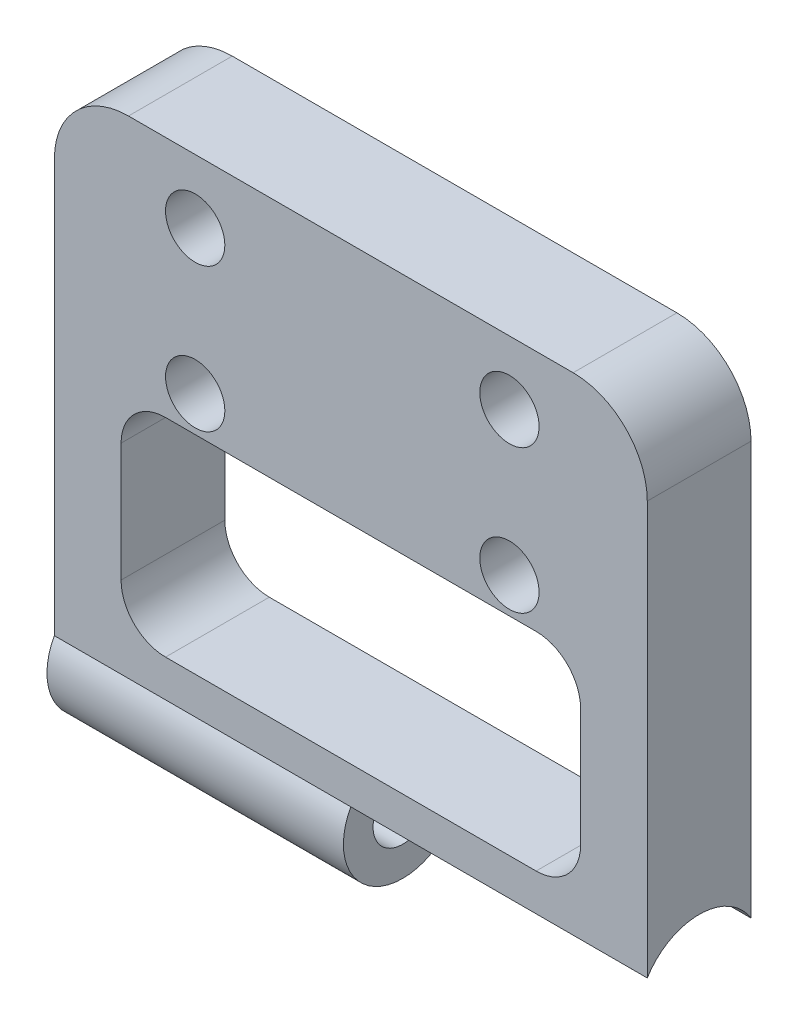
ISO-10303-21;
HEADER;
FILE_DESCRIPTION(('STEP AP214'),'2;1');
FILE_NAME('part.step','',(''),(''),'','','');
FILE_SCHEMA(('AUTOMOTIVE_DESIGN { 1 0 10303 214 1 1 1 1 }'));
ENDSEC;
DATA;
#1=APPLICATION_CONTEXT('core data for automotive mechanical design processes');
#2=APPLICATION_PROTOCOL_DEFINITION('international standard','automotive_design',2000,#1);
#3=PRODUCT_CONTEXT('',#1,'mechanical');
#4=PRODUCT('Part','Part','',(#3));
#5=PRODUCT_RELATED_PRODUCT_CATEGORY('part','',(#4));
#6=PRODUCT_DEFINITION_FORMATION('','',#4);
#7=PRODUCT_DEFINITION_CONTEXT('part definition',#1,'design');
#8=PRODUCT_DEFINITION('design','',#6,#7);
#9=PRODUCT_DEFINITION_SHAPE('','',#8);
#10=(LENGTH_UNIT() NAMED_UNIT(*) SI_UNIT(.MILLI.,.METRE.));
#11=(NAMED_UNIT(*) PLANE_ANGLE_UNIT() SI_UNIT($,.RADIAN.));
#12=(NAMED_UNIT(*) SI_UNIT($,.STERADIAN.) SOLID_ANGLE_UNIT());
#13=UNCERTAINTY_MEASURE_WITH_UNIT(LENGTH_MEASURE(1.E-05),#10,'distance_accuracy_value','');
#14=(GEOMETRIC_REPRESENTATION_CONTEXT(3) GLOBAL_UNCERTAINTY_ASSIGNED_CONTEXT((#13)) GLOBAL_UNIT_ASSIGNED_CONTEXT((#10,
#11,#12)) REPRESENTATION_CONTEXT('',''));
#15=CARTESIAN_POINT('',(0.,0.,0.));
#16=DIRECTION('',(0.,0.,1.));
#17=DIRECTION('',(1.,0.,0.));
#18=AXIS2_PLACEMENT_3D('',#15,#16,#17);
#19=CARTESIAN_POINT('',(0.,0.,7.));
#20=DIRECTION('',(0.,0.,1.));
#21=DIRECTION('',(1.,0.,0.));
#22=AXIS2_PLACEMENT_3D('',#19,#20,#21);
#23=PLANE('',#22);
#24=DIRECTION('',(0.,-1.,0.));
#25=VECTOR('',#24,1.);
#26=CARTESIAN_POINT('',(-17.7292131790813,0.,7.));
#27=LINE('',#26,#25);
#28=CARTESIAN_POINT('',(-17.7292131790813,-2.9002044023642,7.));
#29=VERTEX_POINT('',#28);
#30=CARTESIAN_POINT('',(-17.7292131790813,-10.9002044023642,7.));
#31=VERTEX_POINT('',#30);
#32=EDGE_CURVE('E234',#29,#31,#27,.T.);
#33=ORIENTED_EDGE('',*,*,#32,.F.);
#34=CARTESIAN_POINT('',(-14.7292131790813,-2.9002044023642,7.));
#35=DIRECTION('',(0.,0.,1.));
#36=DIRECTION('',(1.,0.,0.));
#37=AXIS2_PLACEMENT_3D('',#34,#35,#36);
#38=CIRCLE('',#37,3.);
#39=CARTESIAN_POINT('',(-14.7292131790813,0.0997955976357979,7.));
#40=VERTEX_POINT('',#39);
#41=EDGE_CURVE('E11',#29,#40,#38,.F.);
#42=ORIENTED_EDGE('',*,*,#41,.T.);
#43=DIRECTION('',(-1.,0.,0.));
#44=VECTOR('',#43,1.);
#45=CARTESIAN_POINT('',(0.,0.0997955976357961,7.));
#46=LINE('',#45,#44);
#47=CARTESIAN_POINT('',(10.2707868209187,0.0997955976357948,7.));
#48=VERTEX_POINT('',#47);
#49=EDGE_CURVE('E302',#48,#40,#46,.T.);
#50=ORIENTED_EDGE('',*,*,#49,.F.);
#51=CARTESIAN_POINT('',(10.2707868209187,-2.90020440236421,7.));
#52=DIRECTION('',(0.,0.,1.));
#53=DIRECTION('',(1.,0.,0.));
#54=AXIS2_PLACEMENT_3D('',#51,#52,#53);
#55=CIRCLE('',#54,3.);
#56=CARTESIAN_POINT('',(13.2707868209187,-2.90020440236421,7.));
#57=VERTEX_POINT('',#56);
#58=EDGE_CURVE('E220',#48,#57,#55,.F.);
#59=ORIENTED_EDGE('',*,*,#58,.T.);
#60=DIRECTION('',(0.,1.,0.));
#61=VECTOR('',#60,1.);
#62=CARTESIAN_POINT('',(13.2707868209187,0.,7.));
#63=LINE('',#62,#61);
#64=CARTESIAN_POINT('',(13.2707868209187,-10.9002044023642,7.));
#65=VERTEX_POINT('',#64);
#66=EDGE_CURVE('E299',#65,#57,#63,.T.);
#67=ORIENTED_EDGE('',*,*,#66,.F.);
#68=CARTESIAN_POINT('',(10.2707868209187,-10.9002044023642,7.));
#69=DIRECTION('',(0.,0.,1.));
#70=DIRECTION('',(1.,0.,0.));
#71=AXIS2_PLACEMENT_3D('',#68,#69,#70);
#72=CIRCLE('',#71,3.);
#73=CARTESIAN_POINT('',(10.2707868209187,-13.9002044023642,7.));
#74=VERTEX_POINT('',#73);
#75=EDGE_CURVE('E224',#65,#74,#72,.F.);
#76=ORIENTED_EDGE('',*,*,#75,.T.);
#77=DIRECTION('',(1.,0.,0.));
#78=VECTOR('',#77,1.);
#79=CARTESIAN_POINT('',(0.,-13.9002044023642,7.));
#80=LINE('',#79,#78);
#81=CARTESIAN_POINT('',(-14.7292131790813,-13.9002044023642,7.));
#82=VERTEX_POINT('',#81);
#83=EDGE_CURVE('E237',#82,#74,#80,.T.);
#84=ORIENTED_EDGE('',*,*,#83,.F.);
#85=CARTESIAN_POINT('',(-14.7292131790813,-10.9002044023642,7.));
#86=DIRECTION('',(0.,0.,1.));
#87=DIRECTION('',(1.,0.,0.));
#88=AXIS2_PLACEMENT_3D('',#85,#86,#87);
#89=CIRCLE('',#88,3.);
#90=EDGE_CURVE('E227',#82,#31,#89,.F.);
#91=ORIENTED_EDGE('',*,*,#90,.T.);
#92=EDGE_LOOP('',(#33,#42,#50,#59,#67,#76,#84,#91));
#93=FACE_BOUND('',#92,.T.);
#94=CARTESIAN_POINT('',(8.47078682091913,2.4893799472293,7.));
#95=DIRECTION('',(0.,0.,1.));
#96=DIRECTION('',(1.,0.,0.));
#97=AXIS2_PLACEMENT_3D('',#94,#95,#96);
#98=CIRCLE('',#97,2.0000000000005);
#99=CARTESIAN_POINT('',(10.4707868209196,2.4893799472293,7.));
#100=VERTEX_POINT('',#99);
#101=EDGE_CURVE('E315',#100,#100,#98,.T.);
#102=ORIENTED_EDGE('',*,*,#101,.F.);
#103=EDGE_LOOP('',(#102));
#104=FACE_BOUND('',#103,.T.);
#105=CARTESIAN_POINT('',(-12.7292131790809,2.48937994722929,7.));
#106=DIRECTION('',(0.,0.,1.));
#107=DIRECTION('',(1.,0.,0.));
#108=AXIS2_PLACEMENT_3D('',#105,#106,#107);
#109=CIRCLE('',#108,2.0000000000005);
#110=CARTESIAN_POINT('',(-10.7292131790804,2.48937994722929,7.));
#111=VERTEX_POINT('',#110);
#112=EDGE_CURVE('E321',#111,#111,#109,.T.);
#113=ORIENTED_EDGE('',*,*,#112,.F.);
#114=EDGE_LOOP('',(#113));
#115=FACE_BOUND('',#114,.T.);
#116=CARTESIAN_POINT('',(-12.7292131790809,12.1643799472293,7.));
#117=DIRECTION('',(0.,0.,1.));
#118=DIRECTION('',(1.,0.,0.));
#119=AXIS2_PLACEMENT_3D('',#116,#117,#118);
#120=CIRCLE('',#119,2.0000000000005);
#121=CARTESIAN_POINT('',(-10.7292131790804,12.1643799472293,7.));
#122=VERTEX_POINT('',#121);
#123=EDGE_CURVE('E327',#122,#122,#120,.T.);
#124=ORIENTED_EDGE('',*,*,#123,.F.);
#125=EDGE_LOOP('',(#124));
#126=FACE_BOUND('',#125,.T.);
#127=CARTESIAN_POINT('',(8.47078682091913,12.1643799472293,7.));
#128=DIRECTION('',(0.,0.,1.));
#129=DIRECTION('',(1.,0.,0.));
#130=AXIS2_PLACEMENT_3D('',#127,#128,#129);
#131=CIRCLE('',#130,2.0000000000005);
#132=CARTESIAN_POINT('',(10.4707868209196,12.1643799472293,7.));
#133=VERTEX_POINT('',#132);
#134=EDGE_CURVE('E333',#133,#133,#131,.T.);
#135=ORIENTED_EDGE('',*,*,#134,.F.);
#136=EDGE_LOOP('',(#135));
#137=FACE_BOUND('',#136,.T.);
#138=DIRECTION('',(-1.,0.,0.));
#139=VECTOR('',#138,1.);
#140=CARTESIAN_POINT('',(-22.2292131790813,16.4643799472296,7.));
#141=LINE('',#140,#139);
#142=CARTESIAN_POINT('',(12.7707868209187,16.4643799472296,7.));
#143=VERTEX_POINT('',#142);
#144=CARTESIAN_POINT('',(-17.2292131790813,16.4643799472296,7.));
#145=VERTEX_POINT('',#144);
#146=EDGE_CURVE('E173',#143,#145,#141,.T.);
#147=ORIENTED_EDGE('',*,*,#146,.T.);
#148=CARTESIAN_POINT('',(-17.2292131790813,11.4643799472296,7.));
#149=DIRECTION('',(0.,0.,1.));
#150=DIRECTION('',(1.,0.,0.));
#151=AXIS2_PLACEMENT_3D('',#148,#149,#150);
#152=CIRCLE('',#151,5.);
#153=CARTESIAN_POINT('',(-22.2292131790813,11.4643799472296,7.));
#154=VERTEX_POINT('',#153);
#155=EDGE_CURVE('E195',#145,#154,#152,.T.);
#156=ORIENTED_EDGE('',*,*,#155,.T.);
#157=DIRECTION('',(0.,-1.,0.));
#158=VECTOR('',#157,1.);
#159=CARTESIAN_POINT('',(-22.2292131790813,16.4643799472296,7.));
#160=LINE('',#159,#158);
#161=CARTESIAN_POINT('',(-22.2292131790813,-16.4002044023642,7.));
#162=VERTEX_POINT('',#161);
#163=EDGE_CURVE('E346',#154,#162,#160,.T.);
#164=ORIENTED_EDGE('',*,*,#163,.T.);
#165=DIRECTION('',(-1.,0.,0.));
#166=VECTOR('',#165,1.);
#167=CARTESIAN_POINT('',(-2.22921317908127,-16.4002044023642,7.));
#168=LINE('',#167,#166);
#169=CARTESIAN_POINT('',(-2.22921317908127,-16.4002044023642,7.));
#170=VERTEX_POINT('',#169);
#171=EDGE_CURVE('E150',#162,#170,#168,.F.);
#172=ORIENTED_EDGE('',*,*,#171,.T.);
#173=DIRECTION('',(1.,0.,0.));
#174=VECTOR('',#173,1.);
#175=CARTESIAN_POINT('',(-2.22921317908127,-16.4002044023642,7.));
#176=LINE('',#175,#174);
#177=CARTESIAN_POINT('',(17.7707868209187,-16.4002044023642,7.));
#178=VERTEX_POINT('',#177);
#179=EDGE_CURVE('E165',#178,#170,#176,.F.);
#180=ORIENTED_EDGE('',*,*,#179,.F.);
#181=DIRECTION('',(0.,1.,0.));
#182=VECTOR('',#181,1.);
#183=CARTESIAN_POINT('',(17.7707868209187,16.4643799472296,7.));
#184=LINE('',#183,#182);
#185=CARTESIAN_POINT('',(17.7707868209187,11.4643799472296,7.));
#186=VERTEX_POINT('',#185);
#187=EDGE_CURVE('E179',#178,#186,#184,.T.);
#188=ORIENTED_EDGE('',*,*,#187,.T.);
#189=CARTESIAN_POINT('',(12.7707868209187,11.4643799472296,7.));
#190=DIRECTION('',(0.,0.,1.));
#191=DIRECTION('',(1.,0.,0.));
#192=AXIS2_PLACEMENT_3D('',#189,#190,#191);
#193=CIRCLE('',#192,5.);
#194=EDGE_CURVE('E193',#186,#143,#193,.T.);
#195=ORIENTED_EDGE('',*,*,#194,.T.);
#196=EDGE_LOOP('',(#147,#156,#164,#172,#180,#188,#195));
#197=FACE_BOUND('',#196,.T.);
#198=ADVANCED_FACE('F32',(#93,#104,#115,#126,#137,#197),#23,.T.);
#199=CARTESIAN_POINT('',(0.,0.,0.));
#200=DIRECTION('',(0.,0.,1.));
#201=DIRECTION('',(1.,0.,0.));
#202=AXIS2_PLACEMENT_3D('',#199,#200,#201);
#203=PLANE('',#202);
#204=DIRECTION('',(1.,0.,0.));
#205=VECTOR('',#204,1.);
#206=CARTESIAN_POINT('',(-17.7292131790813,0.0997955976357982,0.));
#207=LINE('',#206,#205);
#208=CARTESIAN_POINT('',(-14.7292131790813,0.0997955976357979,0.));
#209=VERTEX_POINT('',#208);
#210=CARTESIAN_POINT('',(10.2707868209187,0.0997955976357948,0.));
#211=VERTEX_POINT('',#210);
#212=EDGE_CURVE('E406',#209,#211,#207,.T.);
#213=ORIENTED_EDGE('',*,*,#212,.F.);
#214=CARTESIAN_POINT('',(-14.7292131790813,-2.9002044023642,0.));
#215=DIRECTION('',(0.,0.,1.));
#216=DIRECTION('',(1.,0.,0.));
#217=AXIS2_PLACEMENT_3D('',#214,#215,#216);
#218=CIRCLE('',#217,3.);
#219=CARTESIAN_POINT('',(-17.7292131790813,-2.9002044023642,0.));
#220=VERTEX_POINT('',#219);
#221=EDGE_CURVE('E40',#209,#220,#218,.T.);
#222=ORIENTED_EDGE('',*,*,#221,.T.);
#223=DIRECTION('',(0.,1.,0.));
#224=VECTOR('',#223,1.);
#225=CARTESIAN_POINT('',(-17.7292131790813,0.0997955976357982,0.));
#226=LINE('',#225,#224);
#227=CARTESIAN_POINT('',(-17.7292131790813,-10.9002044023642,0.));
#228=VERTEX_POINT('',#227);
#229=EDGE_CURVE('E409',#228,#220,#226,.T.);
#230=ORIENTED_EDGE('',*,*,#229,.F.);
#231=CARTESIAN_POINT('',(-14.7292131790813,-10.9002044023642,0.));
#232=DIRECTION('',(0.,0.,1.));
#233=DIRECTION('',(1.,0.,0.));
#234=AXIS2_PLACEMENT_3D('',#231,#232,#233);
#235=CIRCLE('',#234,3.);
#236=CARTESIAN_POINT('',(-14.7292131790813,-13.9002044023642,0.));
#237=VERTEX_POINT('',#236);
#238=EDGE_CURVE('E54',#228,#237,#235,.T.);
#239=ORIENTED_EDGE('',*,*,#238,.T.);
#240=DIRECTION('',(-1.,0.,0.));
#241=VECTOR('',#240,1.);
#242=CARTESIAN_POINT('',(-17.7292131790813,-13.9002044023642,0.));
#243=LINE('',#242,#241);
#244=CARTESIAN_POINT('',(10.2707868209187,-13.9002044023642,0.));
#245=VERTEX_POINT('',#244);
#246=EDGE_CURVE('E309',#245,#237,#243,.T.);
#247=ORIENTED_EDGE('',*,*,#246,.F.);
#248=CARTESIAN_POINT('',(10.2707868209187,-10.9002044023642,0.));
#249=DIRECTION('',(0.,0.,1.));
#250=DIRECTION('',(1.,0.,0.));
#251=AXIS2_PLACEMENT_3D('',#248,#249,#250);
#252=CIRCLE('',#251,3.);
#253=CARTESIAN_POINT('',(13.2707868209187,-10.9002044023642,0.));
#254=VERTEX_POINT('',#253);
#255=EDGE_CURVE('E222',#245,#254,#252,.T.);
#256=ORIENTED_EDGE('',*,*,#255,.T.);
#257=DIRECTION('',(0.,-1.,0.));
#258=VECTOR('',#257,1.);
#259=CARTESIAN_POINT('',(13.2707868209187,0.0997955976357944,0.));
#260=LINE('',#259,#258);
#261=CARTESIAN_POINT('',(13.2707868209187,-2.90020440236421,0.));
#262=VERTEX_POINT('',#261);
#263=EDGE_CURVE('E405',#262,#254,#260,.T.);
#264=ORIENTED_EDGE('',*,*,#263,.F.);
#265=CARTESIAN_POINT('',(10.2707868209187,-2.90020440236421,0.));
#266=DIRECTION('',(0.,0.,1.));
#267=DIRECTION('',(1.,0.,0.));
#268=AXIS2_PLACEMENT_3D('',#265,#266,#267);
#269=CIRCLE('',#268,3.);
#270=EDGE_CURVE('E218',#262,#211,#269,.T.);
#271=ORIENTED_EDGE('',*,*,#270,.T.);
#272=EDGE_LOOP('',(#213,#222,#230,#239,#247,#256,#264,#271));
#273=FACE_BOUND('',#272,.T.);
#274=CARTESIAN_POINT('',(8.47078682091913,2.4893799472293,0.));
#275=DIRECTION('',(0.,0.,-1.));
#276=DIRECTION('',(-1.,0.,0.));
#277=AXIS2_PLACEMENT_3D('',#274,#275,#276);
#278=CIRCLE('',#277,2.0000000000005);
#279=CARTESIAN_POINT('',(6.47078682091863,2.4893799472293,0.));
#280=VERTEX_POINT('',#279);
#281=EDGE_CURVE('E241',#280,#280,#278,.T.);
#282=ORIENTED_EDGE('',*,*,#281,.F.);
#283=EDGE_LOOP('',(#282));
#284=FACE_BOUND('',#283,.T.);
#285=CARTESIAN_POINT('',(-12.7292131790809,2.48937994722929,0.));
#286=DIRECTION('',(0.,0.,-1.));
#287=DIRECTION('',(-1.,0.,0.));
#288=AXIS2_PLACEMENT_3D('',#285,#286,#287);
#289=CIRCLE('',#288,2.0000000000005);
#290=CARTESIAN_POINT('',(-14.7292131790814,2.48937994722929,0.));
#291=VERTEX_POINT('',#290);
#292=EDGE_CURVE('E318',#291,#291,#289,.T.);
#293=ORIENTED_EDGE('',*,*,#292,.F.);
#294=EDGE_LOOP('',(#293));
#295=FACE_BOUND('',#294,.T.);
#296=CARTESIAN_POINT('',(-12.7292131790809,12.1643799472293,0.));
#297=DIRECTION('',(0.,0.,-1.));
#298=DIRECTION('',(-1.,0.,0.));
#299=AXIS2_PLACEMENT_3D('',#296,#297,#298);
#300=CIRCLE('',#299,2.0000000000005);
#301=CARTESIAN_POINT('',(-14.7292131790814,12.1643799472293,0.));
#302=VERTEX_POINT('',#301);
#303=EDGE_CURVE('E324',#302,#302,#300,.T.);
#304=ORIENTED_EDGE('',*,*,#303,.F.);
#305=EDGE_LOOP('',(#304));
#306=FACE_BOUND('',#305,.T.);
#307=CARTESIAN_POINT('',(8.47078682091913,12.1643799472293,0.));
#308=DIRECTION('',(0.,0.,-1.));
#309=DIRECTION('',(-1.,0.,0.));
#310=AXIS2_PLACEMENT_3D('',#307,#308,#309);
#311=CIRCLE('',#310,2.0000000000005);
#312=CARTESIAN_POINT('',(6.47078682091863,12.1643799472293,0.));
#313=VERTEX_POINT('',#312);
#314=EDGE_CURVE('E330',#313,#313,#311,.T.);
#315=ORIENTED_EDGE('',*,*,#314,.F.);
#316=EDGE_LOOP('',(#315));
#317=FACE_BOUND('',#316,.T.);
#318=DIRECTION('',(0.,-1.,0.));
#319=VECTOR('',#318,1.);
#320=CARTESIAN_POINT('',(-22.2292131790813,16.4643799472296,0.));
#321=LINE('',#320,#319);
#322=CARTESIAN_POINT('',(-22.2292131790813,11.4643799472296,0.));
#323=VERTEX_POINT('',#322);
#324=CARTESIAN_POINT('',(-22.2292131790813,-16.4002044023642,0.));
#325=VERTEX_POINT('',#324);
#326=EDGE_CURVE('E345',#323,#325,#321,.T.);
#327=ORIENTED_EDGE('',*,*,#326,.F.);
#328=CARTESIAN_POINT('',(-17.2292131790813,11.4643799472296,0.));
#329=DIRECTION('',(0.,0.,1.));
#330=DIRECTION('',(1.,0.,0.));
#331=AXIS2_PLACEMENT_3D('',#328,#329,#330);
#332=CIRCLE('',#331,5.);
#333=CARTESIAN_POINT('',(-17.2292131790813,16.4643799472296,0.));
#334=VERTEX_POINT('',#333);
#335=EDGE_CURVE('E186',#323,#334,#332,.F.);
#336=ORIENTED_EDGE('',*,*,#335,.T.);
#337=DIRECTION('',(-1.,0.,0.));
#338=VECTOR('',#337,1.);
#339=CARTESIAN_POINT('',(-22.2292131790813,16.4643799472296,0.));
#340=LINE('',#339,#338);
#341=CARTESIAN_POINT('',(12.7707868209187,16.4643799472296,0.));
#342=VERTEX_POINT('',#341);
#343=EDGE_CURVE('E182',#342,#334,#340,.T.);
#344=ORIENTED_EDGE('',*,*,#343,.F.);
#345=CARTESIAN_POINT('',(12.7707868209187,11.4643799472296,0.));
#346=DIRECTION('',(0.,0.,1.));
#347=DIRECTION('',(1.,0.,0.));
#348=AXIS2_PLACEMENT_3D('',#345,#346,#347);
#349=CIRCLE('',#348,5.);
#350=CARTESIAN_POINT('',(17.7707868209187,11.4643799472296,0.));
#351=VERTEX_POINT('',#350);
#352=EDGE_CURVE('E176',#342,#351,#349,.F.);
#353=ORIENTED_EDGE('',*,*,#352,.T.);
#354=DIRECTION('',(0.,1.,0.));
#355=VECTOR('',#354,1.);
#356=CARTESIAN_POINT('',(17.7707868209187,16.4643799472296,0.));
#357=LINE('',#356,#355);
#358=CARTESIAN_POINT('',(17.7707868209187,-16.4002044023642,0.));
#359=VERTEX_POINT('',#358);
#360=EDGE_CURVE('E171',#359,#351,#357,.T.);
#361=ORIENTED_EDGE('',*,*,#360,.F.);
#362=DIRECTION('',(1.,0.,0.));
#363=VECTOR('',#362,1.);
#364=CARTESIAN_POINT('',(-2.22921317908127,-16.4002044023642,0.));
#365=LINE('',#364,#363);
#366=CARTESIAN_POINT('',(-2.22921317908127,-16.4002044023642,0.));
#367=VERTEX_POINT('',#366);
#368=EDGE_CURVE('E162',#359,#367,#365,.F.);
#369=ORIENTED_EDGE('',*,*,#368,.T.);
#370=DIRECTION('',(-1.,0.,0.));
#371=VECTOR('',#370,1.);
#372=CARTESIAN_POINT('',(-2.22921317908127,-16.4002044023642,0.));
#373=LINE('',#372,#371);
#374=EDGE_CURVE('E140',#325,#367,#373,.F.);
#375=ORIENTED_EDGE('',*,*,#374,.F.);
#376=EDGE_LOOP('',(#327,#336,#344,#353,#361,#369,#375));
#377=FACE_BOUND('',#376,.T.);
#378=ADVANCED_FACE('F169',(#273,#284,#295,#306,#317,#377),#203,.F.);
#379=CARTESIAN_POINT('',(-22.2292131790813,16.4643799472296,7.));
#380=DIRECTION('',(1.,0.,0.));
#381=DIRECTION('',(0.,1.,0.));
#382=AXIS2_PLACEMENT_3D('',#379,#380,#381);
#383=PLANE('',#382);
#384=CARTESIAN_POINT('',(-22.2292131790813,-18.3366960754679,3.5));
#385=DIRECTION('',(1.,0.,0.));
#386=DIRECTION('',(0.,1.,0.));
#387=AXIS2_PLACEMENT_3D('',#384,#385,#386);
#388=CIRCLE('',#387,2.);
#389=CARTESIAN_POINT('',(-22.2292131790813,-16.3366960754679,3.5));
#390=VERTEX_POINT('',#389);
#391=EDGE_CURVE('E336',#390,#390,#388,.T.);
#392=ORIENTED_EDGE('',*,*,#391,.T.);
#393=EDGE_LOOP('',(#392));
#394=FACE_BOUND('',#393,.T.);
#395=ORIENTED_EDGE('',*,*,#163,.F.);
#396=DIRECTION('',(0.,0.,-1.));
#397=VECTOR('',#396,1.);
#398=CARTESIAN_POINT('',(-22.2292131790813,11.4643799472296,7.));
#399=LINE('',#398,#397);
#400=EDGE_CURVE('E172',#154,#323,#399,.T.);
#401=ORIENTED_EDGE('',*,*,#400,.T.);
#402=ORIENTED_EDGE('',*,*,#326,.T.);
#403=CARTESIAN_POINT('',(-22.2292131790813,-18.3366960754679,3.5));
#404=DIRECTION('',(1.,0.,0.));
#405=DIRECTION('',(0.,1.,0.));
#406=AXIS2_PLACEMENT_3D('',#403,#404,#405);
#407=CIRCLE('',#406,4.);
#408=EDGE_CURVE('E146',#162,#325,#407,.T.);
#409=ORIENTED_EDGE('',*,*,#408,.F.);
#410=EDGE_LOOP('',(#395,#401,#402,#409));
#411=FACE_BOUND('',#410,.T.);
#412=ADVANCED_FACE('F259',(#394,#411),#383,.F.);
#413=CARTESIAN_POINT('',(17.7707868209187,16.4643799472296,7.));
#414=DIRECTION('',(-1.,0.,0.));
#415=DIRECTION('',(0.,-1.,0.));
#416=AXIS2_PLACEMENT_3D('',#413,#414,#415);
#417=PLANE('',#416);
#418=ORIENTED_EDGE('',*,*,#360,.T.);
#419=DIRECTION('',(0.,0.,-1.));
#420=VECTOR('',#419,1.);
#421=CARTESIAN_POINT('',(17.7707868209187,11.4643799472296,7.));
#422=LINE('',#421,#420);
#423=EDGE_CURVE('E197',#351,#186,#422,.F.);
#424=ORIENTED_EDGE('',*,*,#423,.T.);
#425=ORIENTED_EDGE('',*,*,#187,.F.);
#426=CARTESIAN_POINT('',(17.7707868209187,-18.5356200527705,3.5));
#427=DIRECTION('',(1.,0.,0.));
#428=DIRECTION('',(0.,1.,0.));
#429=AXIS2_PLACEMENT_3D('',#426,#427,#428);
#430=CIRCLE('',#429,4.1);
#431=EDGE_CURVE('E166',#359,#178,#430,.T.);
#432=ORIENTED_EDGE('',*,*,#431,.F.);
#433=EDGE_LOOP('',(#418,#424,#425,#432));
#434=FACE_BOUND('',#433,.T.);
#435=ADVANCED_FACE('F267',(#434),#417,.F.);
#436=CARTESIAN_POINT('',(-22.2292131790813,16.4643799472296,7.));
#437=DIRECTION('',(0.,-1.,0.));
#438=DIRECTION('',(0.,0.,-1.));
#439=AXIS2_PLACEMENT_3D('',#436,#437,#438);
#440=PLANE('',#439);
#441=ORIENTED_EDGE('',*,*,#343,.T.);
#442=DIRECTION('',(0.,0.,-1.));
#443=VECTOR('',#442,1.);
#444=CARTESIAN_POINT('',(-17.2292131790813,16.4643799472296,7.));
#445=LINE('',#444,#443);
#446=EDGE_CURVE('E191',#334,#145,#445,.F.);
#447=ORIENTED_EDGE('',*,*,#446,.T.);
#448=ORIENTED_EDGE('',*,*,#146,.F.);
#449=DIRECTION('',(0.,0.,-1.));
#450=VECTOR('',#449,1.);
#451=CARTESIAN_POINT('',(12.7707868209187,16.4643799472296,7.));
#452=LINE('',#451,#450);
#453=EDGE_CURVE('E188',#143,#342,#452,.T.);
#454=ORIENTED_EDGE('',*,*,#453,.T.);
#455=EDGE_LOOP('',(#441,#447,#448,#454));
#456=FACE_BOUND('',#455,.T.);
#457=ADVANCED_FACE('F264',(#456),#440,.F.);
#458=CARTESIAN_POINT('',(-2.22921317908126,-18.5356200527705,3.5));
#459=DIRECTION('',(1.,0.,0.));
#460=DIRECTION('',(0.,1.,0.));
#461=AXIS2_PLACEMENT_3D('',#458,#459,#460);
#462=CYLINDRICAL_SURFACE('',#461,4.1);
#463=ORIENTED_EDGE('',*,*,#179,.T.);
#464=CARTESIAN_POINT('',(-2.22921317908126,-18.5356200527705,3.5));
#465=DIRECTION('',(1.,0.,0.));
#466=DIRECTION('',(0.,1.,0.));
#467=AXIS2_PLACEMENT_3D('',#464,#465,#466);
#468=CIRCLE('',#467,4.1);
#469=EDGE_CURVE('E156',#367,#170,#468,.T.);
#470=ORIENTED_EDGE('',*,*,#469,.F.);
#471=ORIENTED_EDGE('',*,*,#368,.F.);
#472=ORIENTED_EDGE('',*,*,#431,.T.);
#473=EDGE_LOOP('',(#463,#470,#471,#472));
#474=FACE_BOUND('',#473,.T.);
#475=ADVANCED_FACE('F161',(#474),#462,.F.);
#476=CARTESIAN_POINT('',(-2.22921317908126,-18.5356200527705,3.5));
#477=DIRECTION('',(1.,0.,0.));
#478=DIRECTION('',(0.,1.,0.));
#479=AXIS2_PLACEMENT_3D('',#476,#477,#478);
#480=PLANE('',#479);
#481=CARTESIAN_POINT('',(-2.22921317908126,-18.3366960754679,3.5));
#482=DIRECTION('',(1.,0.,0.));
#483=DIRECTION('',(0.,1.,0.));
#484=AXIS2_PLACEMENT_3D('',#481,#482,#483);
#485=CIRCLE('',#484,2.);
#486=CARTESIAN_POINT('',(-2.22921317908127,-16.3366960754679,3.5));
#487=VERTEX_POINT('',#486);
#488=EDGE_CURVE('E157',#487,#487,#485,.T.);
#489=ORIENTED_EDGE('',*,*,#488,.F.);
#490=EDGE_LOOP('',(#489));
#491=FACE_BOUND('',#490,.T.);
#492=ORIENTED_EDGE('',*,*,#469,.T.);
#493=CARTESIAN_POINT('',(-2.22921317908126,-18.3366960754679,3.5));
#494=DIRECTION('',(1.,0.,0.));
#495=DIRECTION('',(0.,1.,0.));
#496=AXIS2_PLACEMENT_3D('',#493,#494,#495);
#497=CIRCLE('',#496,4.);
#498=EDGE_CURVE('E144',#170,#367,#497,.T.);
#499=ORIENTED_EDGE('',*,*,#498,.T.);
#500=EDGE_LOOP('',(#492,#499));
#501=FACE_BOUND('',#500,.T.);
#502=ADVANCED_FACE('F155',(#491,#501),#480,.T.);
#503=CARTESIAN_POINT('',(-2.22921317908126,-18.3366960754679,3.5));
#504=DIRECTION('',(-1.,0.,0.));
#505=DIRECTION('',(0.,-1.,0.));
#506=AXIS2_PLACEMENT_3D('',#503,#504,#505);
#507=CYLINDRICAL_SURFACE('',#506,2.);
#508=ORIENTED_EDGE('',*,*,#488,.T.);
#509=EDGE_LOOP('',(#508));
#510=FACE_BOUND('',#509,.T.);
#511=ORIENTED_EDGE('',*,*,#391,.F.);
#512=EDGE_LOOP('',(#511));
#513=FACE_BOUND('',#512,.T.);
#514=ADVANCED_FACE('F365',(#510,#513),#507,.F.);
#515=CARTESIAN_POINT('',(-2.22921317908126,-18.3366960754679,3.5));
#516=DIRECTION('',(-1.,0.,0.));
#517=DIRECTION('',(0.,-1.,0.));
#518=AXIS2_PLACEMENT_3D('',#515,#516,#517);
#519=CYLINDRICAL_SURFACE('',#518,4.);
#520=ORIENTED_EDGE('',*,*,#171,.F.);
#521=ORIENTED_EDGE('',*,*,#408,.T.);
#522=ORIENTED_EDGE('',*,*,#374,.T.);
#523=ORIENTED_EDGE('',*,*,#498,.F.);
#524=EDGE_LOOP('',(#520,#521,#522,#523));
#525=FACE_BOUND('',#524,.T.);
#526=ADVANCED_FACE('F143',(#525),#519,.T.);
#527=CARTESIAN_POINT('',(-17.2292131790813,11.4643799472296,7.));
#528=DIRECTION('',(0.,0.,-1.));
#529=DIRECTION('',(-1.,0.,0.));
#530=AXIS2_PLACEMENT_3D('',#527,#528,#529);
#531=CYLINDRICAL_SURFACE('',#530,5.);
#532=ORIENTED_EDGE('',*,*,#155,.F.);
#533=ORIENTED_EDGE('',*,*,#446,.F.);
#534=ORIENTED_EDGE('',*,*,#335,.F.);
#535=ORIENTED_EDGE('',*,*,#400,.F.);
#536=EDGE_LOOP('',(#532,#533,#534,#535));
#537=FACE_BOUND('',#536,.T.);
#538=ADVANCED_FACE('F275',(#537),#531,.T.);
#539=CARTESIAN_POINT('',(12.7707868209187,11.4643799472296,7.));
#540=DIRECTION('',(0.,0.,-1.));
#541=DIRECTION('',(-1.,0.,0.));
#542=AXIS2_PLACEMENT_3D('',#539,#540,#541);
#543=CYLINDRICAL_SURFACE('',#542,5.);
#544=ORIENTED_EDGE('',*,*,#194,.F.);
#545=ORIENTED_EDGE('',*,*,#423,.F.);
#546=ORIENTED_EDGE('',*,*,#352,.F.);
#547=ORIENTED_EDGE('',*,*,#453,.F.);
#548=EDGE_LOOP('',(#544,#545,#546,#547));
#549=FACE_BOUND('',#548,.T.);
#550=ADVANCED_FACE('F278',(#549),#543,.T.);
#551=CARTESIAN_POINT('',(8.47078682091913,12.1643799472293,7.5));
#552=DIRECTION('',(0.,0.,-1.));
#553=DIRECTION('',(-1.,0.,0.));
#554=AXIS2_PLACEMENT_3D('',#551,#552,#553);
#555=CYLINDRICAL_SURFACE('',#554,2.0000000000005);
#556=ORIENTED_EDGE('',*,*,#134,.T.);
#557=EDGE_LOOP('',(#556));
#558=FACE_BOUND('',#557,.T.);
#559=ORIENTED_EDGE('',*,*,#314,.T.);
#560=EDGE_LOOP('',(#559));
#561=FACE_BOUND('',#560,.T.);
#562=ADVANCED_FACE('F282',(#558,#561),#555,.F.);
#563=CARTESIAN_POINT('',(-12.7292131790809,12.1643799472293,7.5));
#564=DIRECTION('',(0.,0.,-1.));
#565=DIRECTION('',(-1.,0.,0.));
#566=AXIS2_PLACEMENT_3D('',#563,#564,#565);
#567=CYLINDRICAL_SURFACE('',#566,2.0000000000005);
#568=ORIENTED_EDGE('',*,*,#123,.T.);
#569=EDGE_LOOP('',(#568));
#570=FACE_BOUND('',#569,.T.);
#571=ORIENTED_EDGE('',*,*,#303,.T.);
#572=EDGE_LOOP('',(#571));
#573=FACE_BOUND('',#572,.T.);
#574=ADVANCED_FACE('F379',(#570,#573),#567,.F.);
#575=CARTESIAN_POINT('',(-12.7292131790809,2.48937994722929,7.5));
#576=DIRECTION('',(0.,0.,-1.));
#577=DIRECTION('',(-1.,0.,0.));
#578=AXIS2_PLACEMENT_3D('',#575,#576,#577);
#579=CYLINDRICAL_SURFACE('',#578,2.0000000000005);
#580=ORIENTED_EDGE('',*,*,#112,.T.);
#581=EDGE_LOOP('',(#580));
#582=FACE_BOUND('',#581,.T.);
#583=ORIENTED_EDGE('',*,*,#292,.T.);
#584=EDGE_LOOP('',(#583));
#585=FACE_BOUND('',#584,.T.);
#586=ADVANCED_FACE('F383',(#582,#585),#579,.F.);
#587=CARTESIAN_POINT('',(8.47078682091913,2.4893799472293,7.5));
#588=DIRECTION('',(0.,0.,-1.));
#589=DIRECTION('',(-1.,0.,0.));
#590=AXIS2_PLACEMENT_3D('',#587,#588,#589);
#591=CYLINDRICAL_SURFACE('',#590,2.0000000000005);
#592=ORIENTED_EDGE('',*,*,#101,.T.);
#593=EDGE_LOOP('',(#592));
#594=FACE_BOUND('',#593,.T.);
#595=ORIENTED_EDGE('',*,*,#281,.T.);
#596=EDGE_LOOP('',(#595));
#597=FACE_BOUND('',#596,.T.);
#598=ADVANCED_FACE('F387',(#594,#597),#591,.F.);
#599=CARTESIAN_POINT('',(-17.7292131790813,0.0997955976357982,7.5));
#600=DIRECTION('',(-1.,0.,0.));
#601=DIRECTION('',(0.,0.,1.));
#602=AXIS2_PLACEMENT_3D('',#599,#600,#601);
#603=PLANE('',#602);
#604=ORIENTED_EDGE('',*,*,#32,.T.);
#605=DIRECTION('',(0.,0.,-1.));
#606=VECTOR('',#605,1.);
#607=CARTESIAN_POINT('',(-17.7292131790813,-10.9002044023642,0.));
#608=LINE('',#607,#606);
#609=EDGE_CURVE('E216',#31,#228,#608,.T.);
#610=ORIENTED_EDGE('',*,*,#609,.T.);
#611=ORIENTED_EDGE('',*,*,#229,.T.);
#612=DIRECTION('',(0.,0.,-1.));
#613=VECTOR('',#612,1.);
#614=CARTESIAN_POINT('',(-17.7292131790813,-2.9002044023642,7.));
#615=LINE('',#614,#613);
#616=EDGE_CURVE('E214',#220,#29,#615,.F.);
#617=ORIENTED_EDGE('',*,*,#616,.T.);
#618=EDGE_LOOP('',(#604,#610,#611,#617));
#619=FACE_BOUND('',#618,.T.);
#620=ADVANCED_FACE('F239',(#619),#603,.F.);
#621=CARTESIAN_POINT('',(-17.7292131790813,-13.9002044023642,7.5));
#622=DIRECTION('',(0.,-1.,0.));
#623=DIRECTION('',(1.,0.,0.));
#624=AXIS2_PLACEMENT_3D('',#621,#622,#623);
#625=PLANE('',#624);
#626=ORIENTED_EDGE('',*,*,#83,.T.);
#627=DIRECTION('',(0.,0.,-1.));
#628=VECTOR('',#627,1.);
#629=CARTESIAN_POINT('',(10.2707868209187,-13.9002044023642,0.));
#630=LINE('',#629,#628);
#631=EDGE_CURVE('E211',#74,#245,#630,.T.);
#632=ORIENTED_EDGE('',*,*,#631,.T.);
#633=ORIENTED_EDGE('',*,*,#246,.T.);
#634=DIRECTION('',(0.,0.,-1.));
#635=VECTOR('',#634,1.);
#636=CARTESIAN_POINT('',(-14.7292131790813,-13.9002044023642,7.));
#637=LINE('',#636,#635);
#638=EDGE_CURVE('E209',#237,#82,#637,.F.);
#639=ORIENTED_EDGE('',*,*,#638,.T.);
#640=EDGE_LOOP('',(#626,#632,#633,#639));
#641=FACE_BOUND('',#640,.T.);
#642=ADVANCED_FACE('F393',(#641),#625,.F.);
#643=CARTESIAN_POINT('',(13.2707868209187,0.0997955976357944,7.5));
#644=DIRECTION('',(1.,0.,0.));
#645=DIRECTION('',(0.,1.,0.));
#646=AXIS2_PLACEMENT_3D('',#643,#644,#645);
#647=PLANE('',#646);
#648=ORIENTED_EDGE('',*,*,#66,.T.);
#649=DIRECTION('',(0.,0.,-1.));
#650=VECTOR('',#649,1.);
#651=CARTESIAN_POINT('',(13.2707868209187,-2.90020440236421,0.));
#652=LINE('',#651,#650);
#653=EDGE_CURVE('E201',#57,#262,#652,.T.);
#654=ORIENTED_EDGE('',*,*,#653,.T.);
#655=ORIENTED_EDGE('',*,*,#263,.T.);
#656=DIRECTION('',(0.,0.,-1.));
#657=VECTOR('',#656,1.);
#658=CARTESIAN_POINT('',(13.2707868209187,-10.9002044023642,7.));
#659=LINE('',#658,#657);
#660=EDGE_CURVE('E199',#254,#65,#659,.F.);
#661=ORIENTED_EDGE('',*,*,#660,.T.);
#662=EDGE_LOOP('',(#648,#654,#655,#661));
#663=FACE_BOUND('',#662,.T.);
#664=ADVANCED_FACE('F290',(#663),#647,.F.);
#665=CARTESIAN_POINT('',(-17.7292131790813,0.0997955976357982,7.5));
#666=DIRECTION('',(0.,1.,0.));
#667=DIRECTION('',(-1.,0.,0.));
#668=AXIS2_PLACEMENT_3D('',#665,#666,#667);
#669=PLANE('',#668);
#670=ORIENTED_EDGE('',*,*,#212,.T.);
#671=DIRECTION('',(0.,0.,-1.));
#672=VECTOR('',#671,1.);
#673=CARTESIAN_POINT('',(10.2707868209187,0.0997955976357948,7.));
#674=LINE('',#673,#672);
#675=EDGE_CURVE('E207',#211,#48,#674,.F.);
#676=ORIENTED_EDGE('',*,*,#675,.T.);
#677=ORIENTED_EDGE('',*,*,#49,.T.);
#678=DIRECTION('',(0.,0.,-1.));
#679=VECTOR('',#678,1.);
#680=CARTESIAN_POINT('',(-14.7292131790813,0.0997955976357979,0.));
#681=LINE('',#680,#679);
#682=EDGE_CURVE('E204',#40,#209,#681,.T.);
#683=ORIENTED_EDGE('',*,*,#682,.T.);
#684=EDGE_LOOP('',(#670,#676,#677,#683));
#685=FACE_BOUND('',#684,.T.);
#686=ADVANCED_FACE('F285',(#685),#669,.F.);
#687=CARTESIAN_POINT('',(10.2707868209187,-2.90020440236421,7.5));
#688=DIRECTION('',(0.,0.,1.));
#689=DIRECTION('',(1.,0.,0.));
#690=AXIS2_PLACEMENT_3D('',#687,#688,#689);
#691=CYLINDRICAL_SURFACE('',#690,3.);
#692=ORIENTED_EDGE('',*,*,#58,.F.);
#693=ORIENTED_EDGE('',*,*,#675,.F.);
#694=ORIENTED_EDGE('',*,*,#270,.F.);
#695=ORIENTED_EDGE('',*,*,#653,.F.);
#696=EDGE_LOOP('',(#692,#693,#694,#695));
#697=FACE_BOUND('',#696,.T.);
#698=ADVANCED_FACE('F251',(#697),#691,.F.);
#699=CARTESIAN_POINT('',(10.2707868209187,-10.9002044023642,7.5));
#700=DIRECTION('',(0.,0.,1.));
#701=DIRECTION('',(1.,0.,0.));
#702=AXIS2_PLACEMENT_3D('',#699,#700,#701);
#703=CYLINDRICAL_SURFACE('',#702,3.);
#704=ORIENTED_EDGE('',*,*,#75,.F.);
#705=ORIENTED_EDGE('',*,*,#660,.F.);
#706=ORIENTED_EDGE('',*,*,#255,.F.);
#707=ORIENTED_EDGE('',*,*,#631,.F.);
#708=EDGE_LOOP('',(#704,#705,#706,#707));
#709=FACE_BOUND('',#708,.T.);
#710=ADVANCED_FACE('F245',(#709),#703,.F.);
#711=CARTESIAN_POINT('',(-14.7292131790813,-10.9002044023642,7.5));
#712=DIRECTION('',(0.,0.,1.));
#713=DIRECTION('',(1.,0.,0.));
#714=AXIS2_PLACEMENT_3D('',#711,#712,#713);
#715=CYLINDRICAL_SURFACE('',#714,3.);
#716=ORIENTED_EDGE('',*,*,#90,.F.);
#717=ORIENTED_EDGE('',*,*,#638,.F.);
#718=ORIENTED_EDGE('',*,*,#238,.F.);
#719=ORIENTED_EDGE('',*,*,#609,.F.);
#720=EDGE_LOOP('',(#716,#717,#718,#719));
#721=FACE_BOUND('',#720,.T.);
#722=ADVANCED_FACE('F243',(#721),#715,.F.);
#723=CARTESIAN_POINT('',(-14.7292131790813,-2.9002044023642,7.5));
#724=DIRECTION('',(0.,0.,1.));
#725=DIRECTION('',(1.,0.,0.));
#726=AXIS2_PLACEMENT_3D('',#723,#724,#725);
#727=CYLINDRICAL_SURFACE('',#726,3.);
#728=ORIENTED_EDGE('',*,*,#41,.F.);
#729=ORIENTED_EDGE('',*,*,#616,.F.);
#730=ORIENTED_EDGE('',*,*,#221,.F.);
#731=ORIENTED_EDGE('',*,*,#682,.F.);
#732=EDGE_LOOP('',(#728,#729,#730,#731));
#733=FACE_BOUND('',#732,.T.);
#734=ADVANCED_FACE('F34',(#733),#727,.F.);
#735=CLOSED_SHELL('',(#198,#378,#412,#435,#457,#475,#502,#514,#526,#538,#550,#562,#574,#586,
#598,#620,#642,#664,#686,#698,#710,#722,#734));
#736=MANIFOLD_SOLID_BREP('B2',#735);
#737=ADVANCED_BREP_SHAPE_REPRESENTATION('',(#18,#736),#14);
#738=SHAPE_DEFINITION_REPRESENTATION(#9,#737);
ENDSEC;
END-ISO-10303-21;
